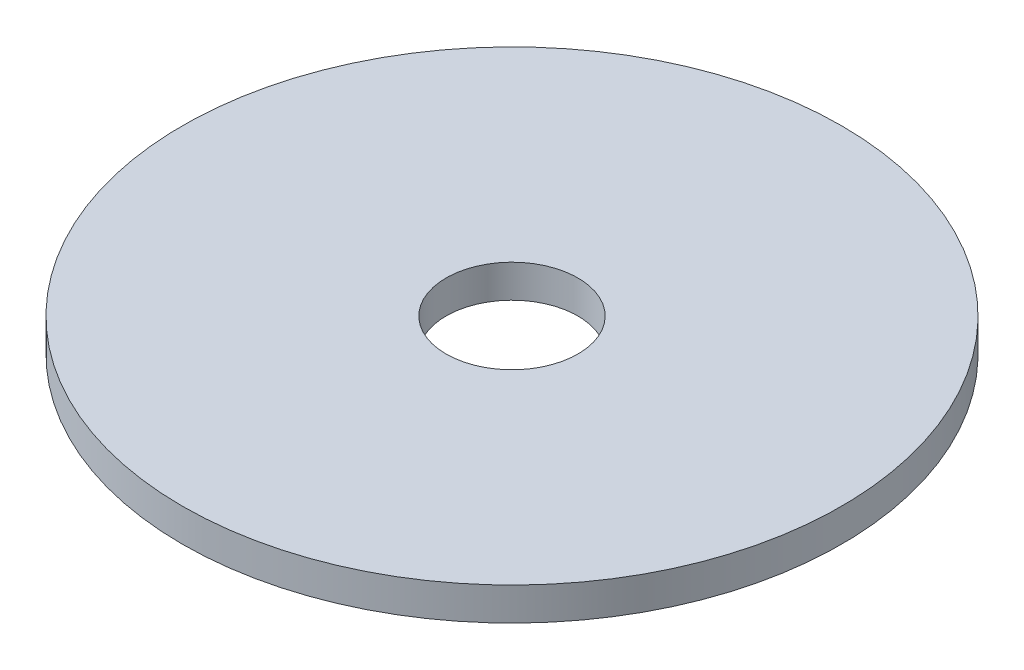
ISO-10303-21;
HEADER;
FILE_DESCRIPTION(('STEP AP214'),'2;1');
FILE_NAME('part.step','',(''),(''),'','','');
FILE_SCHEMA(('AUTOMOTIVE_DESIGN { 1 0 10303 214 1 1 1 1 }'));
ENDSEC;
DATA;
#1=APPLICATION_CONTEXT('core data for automotive mechanical design processes');
#2=APPLICATION_PROTOCOL_DEFINITION('international standard','automotive_design',2000,#1);
#3=PRODUCT_CONTEXT('',#1,'mechanical');
#4=PRODUCT('Part','Part','',(#3));
#5=PRODUCT_RELATED_PRODUCT_CATEGORY('part','',(#4));
#6=PRODUCT_DEFINITION_FORMATION('','',#4);
#7=PRODUCT_DEFINITION_CONTEXT('part definition',#1,'design');
#8=PRODUCT_DEFINITION('design','',#6,#7);
#9=PRODUCT_DEFINITION_SHAPE('','',#8);
#10=(LENGTH_UNIT() NAMED_UNIT(*) SI_UNIT(.MILLI.,.METRE.));
#11=(NAMED_UNIT(*) PLANE_ANGLE_UNIT() SI_UNIT($,.RADIAN.));
#12=(NAMED_UNIT(*) SI_UNIT($,.STERADIAN.) SOLID_ANGLE_UNIT());
#13=UNCERTAINTY_MEASURE_WITH_UNIT(LENGTH_MEASURE(1.E-05),#10,'distance_accuracy_value','');
#14=(GEOMETRIC_REPRESENTATION_CONTEXT(3) GLOBAL_UNCERTAINTY_ASSIGNED_CONTEXT((#13)) GLOBAL_UNIT_ASSIGNED_CONTEXT((#10,
#11,#12)) REPRESENTATION_CONTEXT('',''));
#15=CARTESIAN_POINT('',(0.,0.,0.));
#16=DIRECTION('',(0.,0.,1.));
#17=DIRECTION('',(1.,0.,0.));
#18=AXIS2_PLACEMENT_3D('',#15,#16,#17);
#19=CARTESIAN_POINT('',(0.,6.35,0.));
#20=DIRECTION('',(0.,1.,0.));
#21=DIRECTION('',(0.,0.,1.));
#22=AXIS2_PLACEMENT_3D('',#19,#20,#21);
#23=PLANE('',#22);
#24=CARTESIAN_POINT('',(0.,6.35,0.));
#25=DIRECTION('',(0.,1.,0.));
#26=DIRECTION('',(0.,0.,1.));
#27=AXIS2_PLACEMENT_3D('',#24,#25,#26);
#28=CIRCLE('',#27,63.5);
#29=CARTESIAN_POINT('',(0.,6.35,63.5));
#30=VERTEX_POINT('',#29);
#31=EDGE_CURVE('E10',#30,#30,#28,.T.);
#32=ORIENTED_EDGE('',*,*,#31,.T.);
#33=EDGE_LOOP('',(#32));
#34=FACE_BOUND('',#33,.T.);
#35=CARTESIAN_POINT('',(0.,6.35,0.));
#36=DIRECTION('',(0.,1.,0.));
#37=DIRECTION('',(0.,0.,1.));
#38=AXIS2_PLACEMENT_3D('',#35,#36,#37);
#39=CIRCLE('',#38,12.7);
#40=CARTESIAN_POINT('',(0.,6.35,12.7));
#41=VERTEX_POINT('',#40);
#42=EDGE_CURVE('E50',#41,#41,#39,.T.);
#43=ORIENTED_EDGE('',*,*,#42,.F.);
#44=EDGE_LOOP('',(#43));
#45=FACE_BOUND('',#44,.T.);
#46=ADVANCED_FACE('F37',(#34,#45),#23,.T.);
#47=CARTESIAN_POINT('',(0.,0.,0.));
#48=DIRECTION('',(0.,1.,0.));
#49=DIRECTION('',(0.,0.,1.));
#50=AXIS2_PLACEMENT_3D('',#47,#48,#49);
#51=PLANE('',#50);
#52=CARTESIAN_POINT('',(0.,0.,0.));
#53=DIRECTION('',(0.,1.,0.));
#54=DIRECTION('',(0.,0.,1.));
#55=AXIS2_PLACEMENT_3D('',#52,#53,#54);
#56=CIRCLE('',#55,63.5);
#57=CARTESIAN_POINT('',(0.,0.,63.5));
#58=VERTEX_POINT('',#57);
#59=EDGE_CURVE('E41',#58,#58,#56,.T.);
#60=ORIENTED_EDGE('',*,*,#59,.F.);
#61=EDGE_LOOP('',(#60));
#62=FACE_BOUND('',#61,.T.);
#63=CARTESIAN_POINT('',(0.,0.,0.));
#64=DIRECTION('',(0.,1.,0.));
#65=DIRECTION('',(0.,0.,1.));
#66=AXIS2_PLACEMENT_3D('',#63,#64,#65);
#67=CIRCLE('',#66,12.7);
#68=CARTESIAN_POINT('',(0.,0.,12.7));
#69=VERTEX_POINT('',#68);
#70=EDGE_CURVE('E52',#69,#69,#67,.T.);
#71=ORIENTED_EDGE('',*,*,#70,.T.);
#72=EDGE_LOOP('',(#71));
#73=FACE_BOUND('',#72,.T.);
#74=ADVANCED_FACE('F64',(#62,#73),#51,.F.);
#75=CARTESIAN_POINT('',(0.,6.35,0.));
#76=DIRECTION('',(0.,-1.,0.));
#77=DIRECTION('',(0.,0.,-1.));
#78=AXIS2_PLACEMENT_3D('',#75,#76,#77);
#79=CYLINDRICAL_SURFACE('',#78,63.5);
#80=ORIENTED_EDGE('',*,*,#31,.F.);
#81=EDGE_LOOP('',(#80));
#82=FACE_BOUND('',#81,.T.);
#83=ORIENTED_EDGE('',*,*,#59,.T.);
#84=EDGE_LOOP('',(#83));
#85=FACE_BOUND('',#84,.T.);
#86=ADVANCED_FACE('F39',(#82,#85),#79,.T.);
#87=CARTESIAN_POINT('',(0.,6.35,0.));
#88=DIRECTION('',(0.,-1.,0.));
#89=DIRECTION('',(0.,0.,-1.));
#90=AXIS2_PLACEMENT_3D('',#87,#88,#89);
#91=CYLINDRICAL_SURFACE('',#90,12.7);
#92=ORIENTED_EDGE('',*,*,#42,.T.);
#93=EDGE_LOOP('',(#92));
#94=FACE_BOUND('',#93,.T.);
#95=ORIENTED_EDGE('',*,*,#70,.F.);
#96=EDGE_LOOP('',(#95));
#97=FACE_BOUND('',#96,.T.);
#98=ADVANCED_FACE('F60',(#94,#97),#91,.F.);
#99=CLOSED_SHELL('',(#46,#74,#86,#98));
#100=MANIFOLD_SOLID_BREP('B2',#99);
#101=ADVANCED_BREP_SHAPE_REPRESENTATION('',(#18,#100),#14);
#102=SHAPE_DEFINITION_REPRESENTATION(#9,#101);
ENDSEC;
END-ISO-10303-21;
